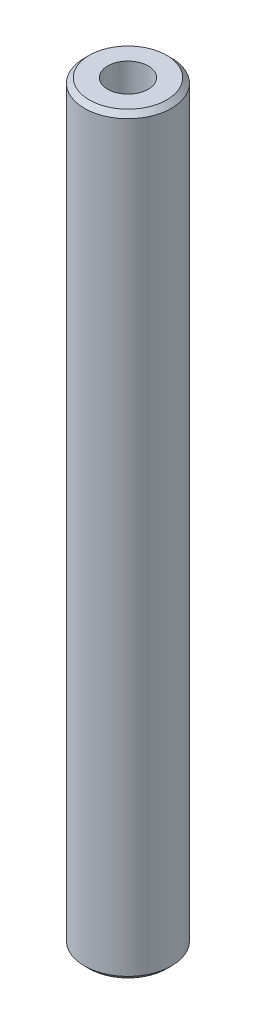
ISO-10303-21;
HEADER;
FILE_DESCRIPTION(('STEP AP214'),'2;1');
FILE_NAME('part.step','',(''),(''),'','','');
FILE_SCHEMA(('AUTOMOTIVE_DESIGN { 1 0 10303 214 1 1 1 1 }'));
ENDSEC;
DATA;
#1=APPLICATION_CONTEXT('core data for automotive mechanical design processes');
#2=APPLICATION_PROTOCOL_DEFINITION('international standard','automotive_design',2000,#1);
#3=PRODUCT_CONTEXT('',#1,'mechanical');
#4=PRODUCT('Part','Part','',(#3));
#5=PRODUCT_RELATED_PRODUCT_CATEGORY('part','',(#4));
#6=PRODUCT_DEFINITION_FORMATION('','',#4);
#7=PRODUCT_DEFINITION_CONTEXT('part definition',#1,'design');
#8=PRODUCT_DEFINITION('design','',#6,#7);
#9=PRODUCT_DEFINITION_SHAPE('','',#8);
#10=(LENGTH_UNIT() NAMED_UNIT(*) SI_UNIT(.MILLI.,.METRE.));
#11=(NAMED_UNIT(*) PLANE_ANGLE_UNIT() SI_UNIT($,.RADIAN.));
#12=(NAMED_UNIT(*) SI_UNIT($,.STERADIAN.) SOLID_ANGLE_UNIT());
#13=UNCERTAINTY_MEASURE_WITH_UNIT(LENGTH_MEASURE(1.E-05),#10,'distance_accuracy_value','');
#14=(GEOMETRIC_REPRESENTATION_CONTEXT(3) GLOBAL_UNCERTAINTY_ASSIGNED_CONTEXT((#13)) GLOBAL_UNIT_ASSIGNED_CONTEXT((#10,
#11,#12)) REPRESENTATION_CONTEXT('',''));
#15=CARTESIAN_POINT('',(0.,0.,0.));
#16=DIRECTION('',(0.,0.,1.));
#17=DIRECTION('',(1.,0.,0.));
#18=AXIS2_PLACEMENT_3D('',#15,#16,#17);
#19=CARTESIAN_POINT('',(0.,172.776034834997,0.));
#20=DIRECTION('',(0.,-1.,0.));
#21=DIRECTION('',(0.,0.,-1.));
#22=AXIS2_PLACEMENT_3D('',#19,#20,#21);
#23=CYLINDRICAL_SURFACE('',#22,10.);
#24=CARTESIAN_POINT('',(0.,171.662861323438,0.));
#25=DIRECTION('',(0.,1.,0.));
#26=DIRECTION('',(0.,0.,1.));
#27=AXIS2_PLACEMENT_3D('',#24,#25,#26);
#28=CIRCLE('',#27,10.);
#29=CARTESIAN_POINT('',(0.,171.662861323438,10.));
#30=VERTEX_POINT('',#29);
#31=EDGE_CURVE('E50',#30,#30,#28,.F.);
#32=ORIENTED_EDGE('',*,*,#31,.T.);
#33=EDGE_LOOP('',(#32));
#34=FACE_BOUND('',#33,.T.);
#35=CARTESIAN_POINT('',(0.,1.1131735115584,0.));
#36=DIRECTION('',(0.,1.,0.));
#37=DIRECTION('',(0.,0.,1.));
#38=AXIS2_PLACEMENT_3D('',#35,#36,#37);
#39=CIRCLE('',#38,10.);
#40=CARTESIAN_POINT('',(0.,1.1131735115584,10.));
#41=VERTEX_POINT('',#40);
#42=EDGE_CURVE('E51',#41,#41,#39,.T.);
#43=ORIENTED_EDGE('',*,*,#42,.T.);
#44=EDGE_LOOP('',(#43));
#45=FACE_BOUND('',#44,.T.);
#46=ADVANCED_FACE('F39',(#34,#45),#23,.T.);
#47=CARTESIAN_POINT('',(0.,172.776034834997,0.));
#48=DIRECTION('',(0.,1.,0.));
#49=DIRECTION('',(0.,0.,1.));
#50=AXIS2_PLACEMENT_3D('',#47,#48,#49);
#51=PLANE('',#50);
#52=CARTESIAN_POINT('',(0.,172.776034834997,0.));
#53=DIRECTION('',(0.,1.,0.));
#54=DIRECTION('',(0.,0.,1.));
#55=AXIS2_PLACEMENT_3D('',#52,#53,#54);
#56=CIRCLE('',#55,8.88682648844154);
#57=CARTESIAN_POINT('',(0.,172.776034834997,8.88682648844154));
#58=VERTEX_POINT('',#57);
#59=EDGE_CURVE('E54',#58,#58,#56,.T.);
#60=ORIENTED_EDGE('',*,*,#59,.T.);
#61=EDGE_LOOP('',(#60));
#62=FACE_BOUND('',#61,.T.);
#63=CARTESIAN_POINT('',(0.,172.776034834997,0.));
#64=DIRECTION('',(0.,1.,0.));
#65=DIRECTION('',(0.,0.,1.));
#66=AXIS2_PLACEMENT_3D('',#63,#64,#65);
#67=CIRCLE('',#66,4.65548808914851);
#68=CARTESIAN_POINT('',(0.,172.776034834997,4.65548808914851));
#69=VERTEX_POINT('',#68);
#70=EDGE_CURVE('E58',#69,#69,#67,.T.);
#71=ORIENTED_EDGE('',*,*,#70,.F.);
#72=EDGE_LOOP('',(#71));
#73=FACE_BOUND('',#72,.T.);
#74=ADVANCED_FACE('F69',(#62,#73),#51,.T.);
#75=CARTESIAN_POINT('',(0.,0.,0.));
#76=DIRECTION('',(0.,1.,0.));
#77=DIRECTION('',(0.,0.,1.));
#78=AXIS2_PLACEMENT_3D('',#75,#76,#77);
#79=PLANE('',#78);
#80=CARTESIAN_POINT('',(0.,0.,0.));
#81=DIRECTION('',(0.,1.,0.));
#82=DIRECTION('',(0.,0.,1.));
#83=AXIS2_PLACEMENT_3D('',#80,#81,#82);
#84=CIRCLE('',#83,8.88682648844158);
#85=CARTESIAN_POINT('',(0.,0.,8.88682648844158));
#86=VERTEX_POINT('',#85);
#87=EDGE_CURVE('E10',#86,#86,#84,.F.);
#88=ORIENTED_EDGE('',*,*,#87,.T.);
#89=EDGE_LOOP('',(#88));
#90=FACE_BOUND('',#89,.T.);
#91=CARTESIAN_POINT('',(0.,0.,0.));
#92=DIRECTION('',(0.,1.,0.));
#93=DIRECTION('',(0.,0.,1.));
#94=AXIS2_PLACEMENT_3D('',#91,#92,#93);
#95=CIRCLE('',#94,4.65548808914851);
#96=CARTESIAN_POINT('',(0.,0.,4.65548808914851));
#97=VERTEX_POINT('',#96);
#98=EDGE_CURVE('E63',#97,#97,#95,.T.);
#99=ORIENTED_EDGE('',*,*,#98,.T.);
#100=EDGE_LOOP('',(#99));
#101=FACE_BOUND('',#100,.T.);
#102=ADVANCED_FACE('F75',(#90,#101),#79,.F.);
#103=CARTESIAN_POINT('',(0.,172.776034834997,0.));
#104=DIRECTION('',(0.,-1.,0.));
#105=DIRECTION('',(0.,0.,-1.));
#106=AXIS2_PLACEMENT_3D('',#103,#104,#105);
#107=CYLINDRICAL_SURFACE('',#106,4.65548808914851);
#108=ORIENTED_EDGE('',*,*,#70,.T.);
#109=EDGE_LOOP('',(#108));
#110=FACE_BOUND('',#109,.T.);
#111=ORIENTED_EDGE('',*,*,#98,.F.);
#112=EDGE_LOOP('',(#111));
#113=FACE_BOUND('',#112,.T.);
#114=ADVANCED_FACE('F70',(#110,#113),#107,.F.);
#115=CARTESIAN_POINT('',(0.,172.776034834997,0.));
#116=DIRECTION('',(0.,-1.,0.));
#117=DIRECTION('',(0.,0.,-1.));
#118=AXIS2_PLACEMENT_3D('',#115,#116,#117);
#119=CONICAL_SURFACE('',#118,8.88682648844154,0.785398163397451);
#120=ORIENTED_EDGE('',*,*,#31,.F.);
#121=EDGE_LOOP('',(#120));
#122=FACE_BOUND('',#121,.T.);
#123=ORIENTED_EDGE('',*,*,#59,.F.);
#124=EDGE_LOOP('',(#123));
#125=FACE_BOUND('',#124,.T.);
#126=ADVANCED_FACE('F81',(#122,#125),#119,.T.);
#127=CARTESIAN_POINT('',(0.,1.1131735115584,0.));
#128=DIRECTION('',(0.,1.,0.));
#129=DIRECTION('',(0.,0.,1.));
#130=AXIS2_PLACEMENT_3D('',#127,#128,#129);
#131=CONICAL_SURFACE('',#130,10.,0.785398163397457);
#132=CARTESIAN_POINT('',(0.,0.,8.88682648844158));
#133=CARTESIAN_POINT('',(0.,0.0115955574120667,8.89842204585365));
#134=CARTESIAN_POINT('',(0.,0.0231911148241333,8.91001760326571));
#135=CARTESIAN_POINT('',(0.,0.0463822296482664,8.93320871808985));
#136=CARTESIAN_POINT('',(0.,0.057977787060333,8.94480427550191));
#137=CARTESIAN_POINT('',(0.,0.0811689018844665,8.96799539032605));
#138=CARTESIAN_POINT('',(0.,0.0927644592965334,8.97959094773811));
#139=CARTESIAN_POINT('',(0.,0.115955574120667,9.00278206256225));
#140=CARTESIAN_POINT('',(0.,0.127551131532733,9.01437761997431));
#141=CARTESIAN_POINT('',(0.,0.150742246356867,9.03756873479845));
#142=CARTESIAN_POINT('',(0.,0.162337803768933,9.04916429221051));
#143=CARTESIAN_POINT('',(0.,0.185528918593067,9.07235540703465));
#144=CARTESIAN_POINT('',(0.,0.197124476005133,9.08395096444672));
#145=CARTESIAN_POINT('',(0.,0.220315590829267,9.10714207927085));
#146=CARTESIAN_POINT('',(0.,0.231911148241334,9.11873763668292));
#147=CARTESIAN_POINT('',(0.,0.255102263065467,9.14192875150705));
#148=CARTESIAN_POINT('',(0.,0.266697820477533,9.15352430891912));
#149=CARTESIAN_POINT('',(0.,0.289888935301667,9.17671542374325));
#150=CARTESIAN_POINT('',(0.,0.301484492713734,9.18831098115532));
#151=CARTESIAN_POINT('',(0.,0.324675607537867,9.21150209597945));
#152=CARTESIAN_POINT('',(0.,0.336271164949934,9.22309765339152));
#153=CARTESIAN_POINT('',(0.,0.359462279774067,9.24628876821565));
#154=CARTESIAN_POINT('',(0.,0.371057837186134,9.25788432562772));
#155=CARTESIAN_POINT('',(0.,0.394248952010267,9.28107544045185));
#156=CARTESIAN_POINT('',(0.,0.405844509422334,9.29267099786392));
#157=CARTESIAN_POINT('',(0.,0.429035624246467,9.31586211268805));
#158=CARTESIAN_POINT('',(0.,0.440631181658534,9.32745767010012));
#159=CARTESIAN_POINT('',(0.,0.463822296482667,9.35064878492425));
#160=CARTESIAN_POINT('',(0.,0.475417853894734,9.36224434233632));
#161=CARTESIAN_POINT('',(0.,0.498608968718867,9.38543545716046));
#162=CARTESIAN_POINT('',(0.,0.510204526130934,9.39703101457252));
#163=CARTESIAN_POINT('',(0.,0.533395640955067,9.42022212939666));
#164=CARTESIAN_POINT('',(0.,0.544991198367134,9.43181768680872));
#165=CARTESIAN_POINT('',(0.,0.568182313191268,9.45500880163286));
#166=CARTESIAN_POINT('',(0.,0.579777870603334,9.46660435904492));
#167=CARTESIAN_POINT('',(0.,0.602968985427467,9.48979547386906));
#168=CARTESIAN_POINT('',(0.,0.614564542839534,9.50139103128112));
#169=CARTESIAN_POINT('',(0.,0.637755657663667,9.52458214610526));
#170=CARTESIAN_POINT('',(0.,0.649351215075734,9.53617770351732));
#171=CARTESIAN_POINT('',(0.,0.672542329899868,9.55936881834146));
#172=CARTESIAN_POINT('',(0.,0.684137887311934,9.57096437575352));
#173=CARTESIAN_POINT('',(0.,0.707329002136068,9.59415549057766));
#174=CARTESIAN_POINT('',(0.,0.718924559548134,9.60575104798973));
#175=CARTESIAN_POINT('',(0.,0.742115674372268,9.62894216281386));
#176=CARTESIAN_POINT('',(0.,0.753711231784335,9.64053772022593));
#177=CARTESIAN_POINT('',(0.,0.776902346608468,9.66372883505006));
#178=CARTESIAN_POINT('',(0.,0.788497904020535,9.67532439246213));
#179=CARTESIAN_POINT('',(0.,0.811689018844668,9.69851550728626));
#180=CARTESIAN_POINT('',(0.,0.823284576256735,9.71011106469833));
#181=CARTESIAN_POINT('',(0.,0.846475691080868,9.73330217952246));
#182=CARTESIAN_POINT('',(0.,0.858071248492935,9.74489773693453));
#183=CARTESIAN_POINT('',(0.,0.881262363317068,9.76808885175866));
#184=CARTESIAN_POINT('',(0.,0.892857920729135,9.77968440917073));
#185=CARTESIAN_POINT('',(0.,0.916049035553268,9.80287552399486));
#186=CARTESIAN_POINT('',(0.,0.927644592965335,9.81447108140693));
#187=CARTESIAN_POINT('',(0.,0.950835707789468,9.83766219623107));
#188=CARTESIAN_POINT('',(0.,0.962431265201535,9.84925775364313));
#189=CARTESIAN_POINT('',(0.,0.985622380025668,9.87244886846726));
#190=CARTESIAN_POINT('',(0.,0.997217937437735,9.88404442587933));
#191=CARTESIAN_POINT('',(0.,1.02040905226187,9.90723554070346));
#192=CARTESIAN_POINT('',(0.,1.03200460967394,9.91883109811553));
#193=CARTESIAN_POINT('',(0.,1.05519572449807,9.94202221293967));
#194=CARTESIAN_POINT('',(0.,1.06679128191014,9.95361777035173));
#195=CARTESIAN_POINT('',(0.,1.08998239673427,9.97680888517587));
#196=CARTESIAN_POINT('',(0.,1.10157795414634,9.98840444258793));
#197=CARTESIAN_POINT('',(0.,1.1131735115584,10.));
#198=B_SPLINE_CURVE_WITH_KNOTS('',3,(#132,#133,#134,#135,#136,#137,#138,#139,#140,#141,#142,
#143,#144,#145,#146,#147,#148,#149,#150,#151,#152,#153,#154,#155,#156,#157,#158,#159,#160,#161,
#162,#163,#164,#165,#166,#167,#168,#169,#170,#171,#172,#173,#174,#175,#176,#177,#178,#179,#180,
#181,#182,#183,#184,#185,#186,#187,#188,#189,#190,#191,#192,#193,#194,#195,#196,#197),
.UNSPECIFIED.,.F.,.F.,(4,2,2,2,2,2,2,2,2,2,2,2,2,2,2,2,2,2,2,2,2,2,2,2,2,2,2,2,2,2,2,2,4),(0.,
0.0491957836662623,0.0983915673325247,0.147587350998786,0.196783134665048,0.24597891833131,
0.295174701997573,0.344370485663835,0.393566269330097,0.442762052996359,0.491957836662621,
0.541153620328883,0.590349403995146,0.639545187661408,0.68874097132767,0.737936754993933,
0.787132538660194,0.836328322326456,0.885524105992718,0.934719889658981,0.983915673325243,
1.03311145699151,1.08230724065777,1.13150302432403,1.18069880799029,1.22989459165655,
1.27909037532282,1.32828615898908,1.37748194265534,1.4266777263216,1.47587350998786,
1.52506929365413,1.57426507732039),.UNSPECIFIED.);
#199=EDGE_CURVE('BSEAM45',#86,#41,#198,.T.);
#200=ORIENTED_EDGE('',*,*,#87,.F.);
#201=ORIENTED_EDGE('',*,*,#42,.F.);
#202=ORIENTED_EDGE('',*,*,#199,.T.);
#203=ORIENTED_EDGE('',*,*,#199,.F.);
#204=EDGE_LOOP('',(#200,#202,#201,#203));
#205=FACE_BOUND('',#204,.T.);
#206=ADVANCED_FACE('F45',(#205),#131,.T.);
#207=CLOSED_SHELL('',(#46,#74,#102,#114,#126,#206));
#208=MANIFOLD_SOLID_BREP('B2',#207);
#209=ADVANCED_BREP_SHAPE_REPRESENTATION('',(#18,#208),#14);
#210=SHAPE_DEFINITION_REPRESENTATION(#9,#209);
ENDSEC;
END-ISO-10303-21;
